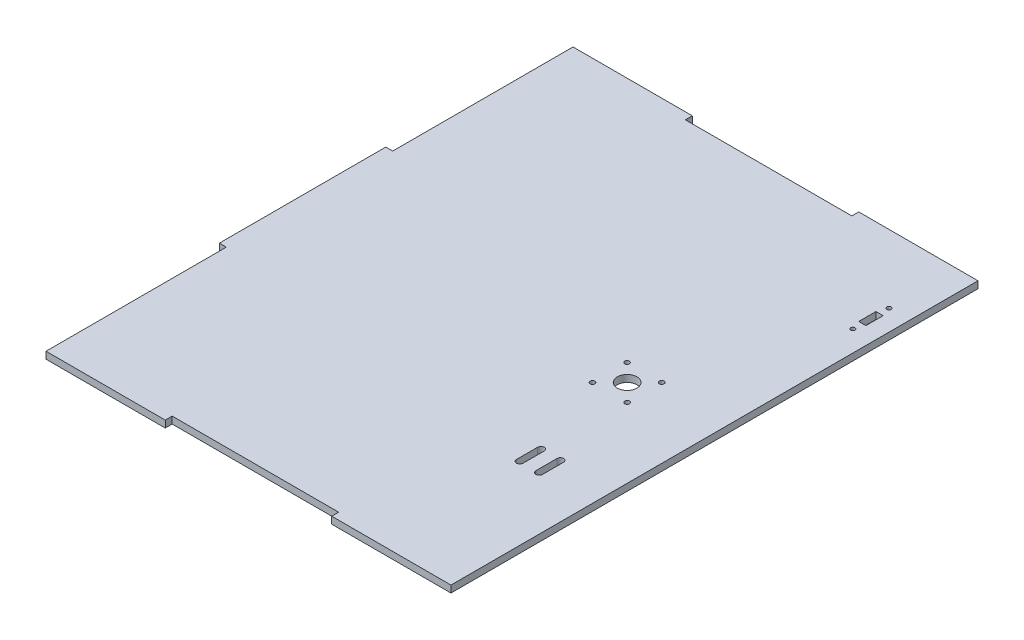
ISO-10303-21;
HEADER;
FILE_DESCRIPTION(('STEP AP214'),'2;1');
FILE_NAME('part.step','',(''),(''),'','','');
FILE_SCHEMA(('AUTOMOTIVE_DESIGN { 1 0 10303 214 1 1 1 1 }'));
ENDSEC;
DATA;
#1=APPLICATION_CONTEXT('core data for automotive mechanical design processes');
#2=APPLICATION_PROTOCOL_DEFINITION('international standard','automotive_design',2000,#1);
#3=PRODUCT_CONTEXT('',#1,'mechanical');
#4=PRODUCT('Part','Part','',(#3));
#5=PRODUCT_RELATED_PRODUCT_CATEGORY('part','',(#4));
#6=PRODUCT_DEFINITION_FORMATION('','',#4);
#7=PRODUCT_DEFINITION_CONTEXT('part definition',#1,'design');
#8=PRODUCT_DEFINITION('design','',#6,#7);
#9=PRODUCT_DEFINITION_SHAPE('','',#8);
#10=(LENGTH_UNIT() NAMED_UNIT(*) SI_UNIT(.MILLI.,.METRE.));
#11=(NAMED_UNIT(*) PLANE_ANGLE_UNIT() SI_UNIT($,.RADIAN.));
#12=(NAMED_UNIT(*) SI_UNIT($,.STERADIAN.) SOLID_ANGLE_UNIT());
#13=UNCERTAINTY_MEASURE_WITH_UNIT(LENGTH_MEASURE(1.E-05),#10,'distance_accuracy_value','');
#14=(GEOMETRIC_REPRESENTATION_CONTEXT(3) GLOBAL_UNCERTAINTY_ASSIGNED_CONTEXT((#13)) GLOBAL_UNIT_ASSIGNED_CONTEXT((#10,
#11,#12)) REPRESENTATION_CONTEXT('',''));
#15=CARTESIAN_POINT('',(0.,0.,0.));
#16=DIRECTION('',(0.,0.,1.));
#17=DIRECTION('',(1.,0.,0.));
#18=AXIS2_PLACEMENT_3D('',#15,#16,#17);
#19=CARTESIAN_POINT('',(0.,3.175,0.));
#20=DIRECTION('',(1.,0.,0.));
#21=DIRECTION('',(0.,0.,-1.));
#22=AXIS2_PLACEMENT_3D('',#19,#20,#21);
#23=PLANE('',#22);
#24=DIRECTION('',(0.,1.,0.));
#25=VECTOR('',#24,1.);
#26=CARTESIAN_POINT('',(0.,-76.2661171490984,-82.55));
#27=LINE('',#26,#25);
#28=CARTESIAN_POINT('',(0.,0.,-82.55));
#29=VERTEX_POINT('',#28);
#30=CARTESIAN_POINT('',(0.,3.175,-82.55));
#31=VERTEX_POINT('',#30);
#32=EDGE_CURVE('E249',#29,#31,#27,.T.);
#33=ORIENTED_EDGE('',*,*,#32,.F.);
#34=DIRECTION('',(0.,0.,1.));
#35=VECTOR('',#34,1.);
#36=CARTESIAN_POINT('',(0.,0.,0.));
#37=LINE('',#36,#35);
#38=CARTESIAN_POINT('',(0.,0.,0.));
#39=VERTEX_POINT('',#38);
#40=EDGE_CURVE('E439',#29,#39,#37,.T.);
#41=ORIENTED_EDGE('',*,*,#40,.T.);
#42=DIRECTION('',(0.,-1.,0.));
#43=VECTOR('',#42,1.);
#44=CARTESIAN_POINT('',(0.,3.175,0.));
#45=LINE('',#44,#43);
#46=CARTESIAN_POINT('',(0.,3.175,0.));
#47=VERTEX_POINT('',#46);
#48=EDGE_CURVE('E11',#47,#39,#45,.T.);
#49=ORIENTED_EDGE('',*,*,#48,.F.);
#50=DIRECTION('',(0.,0.,1.));
#51=VECTOR('',#50,1.);
#52=CARTESIAN_POINT('',(0.,3.175,0.));
#53=LINE('',#52,#51);
#54=EDGE_CURVE('E446',#31,#47,#53,.T.);
#55=ORIENTED_EDGE('',*,*,#54,.F.);
#56=EDGE_LOOP('',(#33,#41,#49,#55));
#57=FACE_BOUND('',#56,.T.);
#58=ADVANCED_FACE('F34',(#57),#23,.F.);
#59=CARTESIAN_POINT('',(0.,3.175,0.));
#60=DIRECTION('',(0.,0.,-1.));
#61=DIRECTION('',(-1.,0.,0.));
#62=AXIS2_PLACEMENT_3D('',#59,#60,#61);
#63=PLANE('',#62);
#64=DIRECTION('',(1.,0.,0.));
#65=VECTOR('',#64,1.);
#66=CARTESIAN_POINT('',(0.,0.,0.));
#67=LINE('',#66,#65);
#68=CARTESIAN_POINT('',(54.6100000000003,0.,0.));
#69=VERTEX_POINT('',#68);
#70=EDGE_CURVE('E460',#39,#69,#67,.T.);
#71=ORIENTED_EDGE('',*,*,#70,.T.);
#72=DIRECTION('',(0.,1.,0.));
#73=VECTOR('',#72,1.);
#74=CARTESIAN_POINT('',(54.6100000000003,0.,0.));
#75=LINE('',#74,#73);
#76=CARTESIAN_POINT('',(54.6100000000003,3.175,0.));
#77=VERTEX_POINT('',#76);
#78=EDGE_CURVE('E262',#69,#77,#75,.T.);
#79=ORIENTED_EDGE('',*,*,#78,.T.);
#80=DIRECTION('',(1.,0.,0.));
#81=VECTOR('',#80,1.);
#82=CARTESIAN_POINT('',(0.,3.175,0.));
#83=LINE('',#82,#81);
#84=EDGE_CURVE('E447',#47,#77,#83,.T.);
#85=ORIENTED_EDGE('',*,*,#84,.F.);
#86=ORIENTED_EDGE('',*,*,#48,.T.);
#87=EDGE_LOOP('',(#71,#79,#85,#86));
#88=FACE_BOUND('',#87,.T.);
#89=ADVANCED_FACE('F505',(#88),#63,.F.);
#90=CARTESIAN_POINT('',(0.,3.175,-241.3));
#91=DIRECTION('',(0.,0.,1.));
#92=DIRECTION('',(1.,0.,0.));
#93=AXIS2_PLACEMENT_3D('',#90,#91,#92);
#94=PLANE('',#93);
#95=DIRECTION('',(-1.,0.,0.));
#96=VECTOR('',#95,1.);
#97=CARTESIAN_POINT('',(0.,0.,-241.3));
#98=LINE('',#97,#96);
#99=CARTESIAN_POINT('',(185.42,0.,-241.3));
#100=VERTEX_POINT('',#99);
#101=CARTESIAN_POINT('',(130.81,0.,-241.3));
#102=VERTEX_POINT('',#101);
#103=EDGE_CURVE('E466',#100,#102,#98,.T.);
#104=ORIENTED_EDGE('',*,*,#103,.T.);
#105=DIRECTION('',(0.,1.,0.));
#106=VECTOR('',#105,1.);
#107=CARTESIAN_POINT('',(130.81,0.,-241.3));
#108=LINE('',#107,#106);
#109=CARTESIAN_POINT('',(130.81,3.175,-241.3));
#110=VERTEX_POINT('',#109);
#111=EDGE_CURVE('E288',#102,#110,#108,.T.);
#112=ORIENTED_EDGE('',*,*,#111,.T.);
#113=DIRECTION('',(-1.,0.,0.));
#114=VECTOR('',#113,1.);
#115=CARTESIAN_POINT('',(0.,3.175,-241.3));
#116=LINE('',#115,#114);
#117=CARTESIAN_POINT('',(185.42,3.175,-241.3));
#118=VERTEX_POINT('',#117);
#119=EDGE_CURVE('E453',#118,#110,#116,.T.);
#120=ORIENTED_EDGE('',*,*,#119,.F.);
#121=DIRECTION('',(0.,-1.,0.));
#122=VECTOR('',#121,1.);
#123=CARTESIAN_POINT('',(185.42,3.175,-241.3));
#124=LINE('',#123,#122);
#125=EDGE_CURVE('E471',#118,#100,#124,.T.);
#126=ORIENTED_EDGE('',*,*,#125,.T.);
#127=EDGE_LOOP('',(#104,#112,#120,#126));
#128=FACE_BOUND('',#127,.T.);
#129=ADVANCED_FACE('F486',(#128),#94,.F.);
#130=CARTESIAN_POINT('',(0.,3.175,0.));
#131=DIRECTION('',(0.,-1.,0.));
#132=DIRECTION('',(0.,0.,-1.));
#133=AXIS2_PLACEMENT_3D('',#130,#131,#132);
#134=PLANE('',#133);
#135=CARTESIAN_POINT('',(175.895,3.175,-193.548));
#136=DIRECTION('',(0.,-1.,0.));
#137=DIRECTION('',(0.,0.,-1.));
#138=AXIS2_PLACEMENT_3D('',#135,#136,#137);
#139=CIRCLE('',#138,0.999999999999998);
#140=CARTESIAN_POINT('',(175.895,3.175,-194.548));
#141=VERTEX_POINT('',#140);
#142=EDGE_CURVE('E304',#141,#141,#139,.T.);
#143=ORIENTED_EDGE('',*,*,#142,.T.);
#144=EDGE_LOOP('',(#143));
#145=FACE_BOUND('',#144,.T.);
#146=CARTESIAN_POINT('',(175.895,3.175,-210.058));
#147=DIRECTION('',(0.,-1.,0.));
#148=DIRECTION('',(0.,0.,1.));
#149=AXIS2_PLACEMENT_3D('',#146,#147,#148);
#150=CIRCLE('',#149,0.999999999999998);
#151=CARTESIAN_POINT('',(175.895,3.175,-209.058));
#152=VERTEX_POINT('',#151);
#153=EDGE_CURVE('E311',#152,#152,#150,.T.);
#154=ORIENTED_EDGE('',*,*,#153,.T.);
#155=EDGE_LOOP('',(#154));
#156=FACE_BOUND('',#155,.T.);
#157=DIRECTION('',(-1.,0.,0.));
#158=VECTOR('',#157,1.);
#159=CARTESIAN_POINT('',(174.244,3.175,-197.866));
#160=LINE('',#159,#158);
#161=CARTESIAN_POINT('',(177.546,3.175,-197.866));
#162=VERTEX_POINT('',#161);
#163=CARTESIAN_POINT('',(174.244,3.175,-197.866));
#164=VERTEX_POINT('',#163);
#165=EDGE_CURVE('E326',#162,#164,#160,.T.);
#166=ORIENTED_EDGE('',*,*,#165,.T.);
#167=DIRECTION('',(0.,0.,-1.));
#168=VECTOR('',#167,1.);
#169=CARTESIAN_POINT('',(174.244,3.175,-205.74));
#170=LINE('',#169,#168);
#171=CARTESIAN_POINT('',(174.244,3.175,-205.74));
#172=VERTEX_POINT('',#171);
#173=EDGE_CURVE('E316',#164,#172,#170,.T.);
#174=ORIENTED_EDGE('',*,*,#173,.T.);
#175=DIRECTION('',(1.,0.,0.));
#176=VECTOR('',#175,1.);
#177=CARTESIAN_POINT('',(174.244,3.175,-205.74));
#178=LINE('',#177,#176);
#179=CARTESIAN_POINT('',(177.546,3.175,-205.74));
#180=VERTEX_POINT('',#179);
#181=EDGE_CURVE('E319',#172,#180,#178,.T.);
#182=ORIENTED_EDGE('',*,*,#181,.T.);
#183=DIRECTION('',(0.,0.,1.));
#184=VECTOR('',#183,1.);
#185=CARTESIAN_POINT('',(177.546,3.175,-205.74));
#186=LINE('',#185,#184);
#187=EDGE_CURVE('E323',#180,#162,#186,.T.);
#188=ORIENTED_EDGE('',*,*,#187,.T.);
#189=EDGE_LOOP('',(#166,#174,#182,#188));
#190=FACE_BOUND('',#189,.T.);
#191=DIRECTION('',(0.,0.,-1.));
#192=VECTOR('',#191,1.);
#193=CARTESIAN_POINT('',(162.515,3.175,-64.796000096));
#194=LINE('',#193,#192);
#195=CARTESIAN_POINT('',(162.515,3.175,-64.796000096));
#196=VERTEX_POINT('',#195);
#197=CARTESIAN_POINT('',(162.515,3.175,-74.496000096));
#198=VERTEX_POINT('',#197);
#199=EDGE_CURVE('E363',#196,#198,#194,.T.);
#200=ORIENTED_EDGE('',*,*,#199,.F.);
#201=CARTESIAN_POINT('',(161.015,3.175,-64.796000096));
#202=DIRECTION('',(0.,1.,0.));
#203=DIRECTION('',(0.,0.,1.));
#204=AXIS2_PLACEMENT_3D('',#201,#202,#203);
#205=CIRCLE('',#204,1.49999999999997);
#206=CARTESIAN_POINT('',(159.515,3.175,-64.796000096));
#207=VERTEX_POINT('',#206);
#208=EDGE_CURVE('E341',#207,#196,#205,.T.);
#209=ORIENTED_EDGE('',*,*,#208,.F.);
#210=DIRECTION('',(0.,0.,1.));
#211=VECTOR('',#210,1.);
#212=CARTESIAN_POINT('',(159.515,3.175,-64.796000096));
#213=LINE('',#212,#211);
#214=CARTESIAN_POINT('',(159.515,3.175,-74.496000096));
#215=VERTEX_POINT('',#214);
#216=EDGE_CURVE('E352',#215,#207,#213,.T.);
#217=ORIENTED_EDGE('',*,*,#216,.F.);
#218=CARTESIAN_POINT('',(161.015,3.175,-74.496000096));
#219=DIRECTION('',(0.,1.,0.));
#220=DIRECTION('',(0.,0.,1.));
#221=AXIS2_PLACEMENT_3D('',#218,#219,#220);
#222=CIRCLE('',#221,1.49999999999997);
#223=EDGE_CURVE('E366',#198,#215,#222,.T.);
#224=ORIENTED_EDGE('',*,*,#223,.F.);
#225=EDGE_LOOP('',(#200,#209,#217,#224));
#226=FACE_BOUND('',#225,.T.);
#227=DIRECTION('',(0.,0.,-1.));
#228=VECTOR('',#227,1.);
#229=CARTESIAN_POINT('',(153.615,3.175,-64.796000096));
#230=LINE('',#229,#228);
#231=CARTESIAN_POINT('',(153.615,3.175,-64.796000096));
#232=VERTEX_POINT('',#231);
#233=CARTESIAN_POINT('',(153.615,3.175,-74.496000096));
#234=VERTEX_POINT('',#233);
#235=EDGE_CURVE('E395',#232,#234,#230,.T.);
#236=ORIENTED_EDGE('',*,*,#235,.F.);
#237=CARTESIAN_POINT('',(152.115,3.175,-64.796000096));
#238=DIRECTION('',(0.,1.,0.));
#239=DIRECTION('',(0.,0.,1.));
#240=AXIS2_PLACEMENT_3D('',#237,#238,#239);
#241=CIRCLE('',#240,1.49999999999997);
#242=CARTESIAN_POINT('',(150.615,3.175,-64.796000096));
#243=VERTEX_POINT('',#242);
#244=EDGE_CURVE('E373',#243,#232,#241,.T.);
#245=ORIENTED_EDGE('',*,*,#244,.F.);
#246=DIRECTION('',(0.,0.,1.));
#247=VECTOR('',#246,1.);
#248=CARTESIAN_POINT('',(150.615,3.175,-64.796000096));
#249=LINE('',#248,#247);
#250=CARTESIAN_POINT('',(150.615,3.175,-74.496000096));
#251=VERTEX_POINT('',#250);
#252=EDGE_CURVE('E384',#251,#243,#249,.T.);
#253=ORIENTED_EDGE('',*,*,#252,.F.);
#254=CARTESIAN_POINT('',(152.115,3.175,-74.496000096));
#255=DIRECTION('',(0.,1.,0.));
#256=DIRECTION('',(0.,0.,1.));
#257=AXIS2_PLACEMENT_3D('',#254,#255,#256);
#258=CIRCLE('',#257,1.49999999999997);
#259=EDGE_CURVE('E398',#234,#251,#258,.T.);
#260=ORIENTED_EDGE('',*,*,#259,.F.);
#261=EDGE_LOOP('',(#236,#245,#253,#260));
#262=FACE_BOUND('',#261,.T.);
#263=CARTESIAN_POINT('',(137.49168741186,3.175,-128.57331258814));
#264=DIRECTION('',(0.,1.,0.));
#265=DIRECTION('',(0.,0.,1.));
#266=AXIS2_PLACEMENT_3D('',#263,#264,#265);
#267=CIRCLE('',#266,1.09220000000001);
#268=CARTESIAN_POINT('',(137.49168741186,3.175,-127.48111258814));
#269=VERTEX_POINT('',#268);
#270=EDGE_CURVE('E425',#269,#269,#267,.T.);
#271=ORIENTED_EDGE('',*,*,#270,.F.);
#272=EDGE_LOOP('',(#271));
#273=FACE_BOUND('',#272,.T.);
#274=CARTESIAN_POINT('',(153.33831258814,3.175,-128.57331258814));
#275=DIRECTION('',(0.,-1.,0.));
#276=DIRECTION('',(0.,0.,-1.));
#277=AXIS2_PLACEMENT_3D('',#274,#275,#276);
#278=CIRCLE('',#277,1.09219999999999);
#279=CARTESIAN_POINT('',(153.33831258814,3.175,-129.66551258814));
#280=VERTEX_POINT('',#279);
#281=EDGE_CURVE('E431',#280,#280,#278,.T.);
#282=ORIENTED_EDGE('',*,*,#281,.T.);
#283=EDGE_LOOP('',(#282));
#284=FACE_BOUND('',#283,.T.);
#285=CARTESIAN_POINT('',(145.415,3.175,-120.65));
#286=DIRECTION('',(0.,1.,0.));
#287=DIRECTION('',(0.,0.,1.));
#288=AXIS2_PLACEMENT_3D('',#285,#286,#287);
#289=CIRCLE('',#288,4.49452999999999);
#290=CARTESIAN_POINT('',(145.415,3.175,-116.15547));
#291=VERTEX_POINT('',#290);
#292=EDGE_CURVE('E415',#291,#291,#289,.T.);
#293=ORIENTED_EDGE('',*,*,#292,.F.);
#294=EDGE_LOOP('',(#293));
#295=FACE_BOUND('',#294,.T.);
#296=ORIENTED_EDGE('',*,*,#84,.T.);
#297=DIRECTION('',(0.,0.,1.));
#298=VECTOR('',#297,1.);
#299=CARTESIAN_POINT('',(54.6100000000003,3.175,0.));
#300=LINE('',#299,#298);
#301=CARTESIAN_POINT('',(54.6100000000003,3.175,-3.17500000000001));
#302=VERTEX_POINT('',#301);
#303=EDGE_CURVE('E254',#302,#77,#300,.T.);
#304=ORIENTED_EDGE('',*,*,#303,.F.);
#305=DIRECTION('',(-1.,0.,0.));
#306=VECTOR('',#305,1.);
#307=CARTESIAN_POINT('',(54.6100000000003,3.175,-3.17500000000001));
#308=LINE('',#307,#306);
#309=CARTESIAN_POINT('',(130.81,3.175,-3.17500000000001));
#310=VERTEX_POINT('',#309);
#311=EDGE_CURVE('E257',#310,#302,#308,.T.);
#312=ORIENTED_EDGE('',*,*,#311,.F.);
#313=DIRECTION('',(0.,0.,-1.));
#314=VECTOR('',#313,1.);
#315=CARTESIAN_POINT('',(130.81,3.175,0.));
#316=LINE('',#315,#314);
#317=CARTESIAN_POINT('',(130.81,3.175,0.));
#318=VERTEX_POINT('',#317);
#319=EDGE_CURVE('E264',#318,#310,#316,.T.);
#320=ORIENTED_EDGE('',*,*,#319,.F.);
#321=CARTESIAN_POINT('',(185.42,3.175,0.));
#322=VERTEX_POINT('',#321);
#323=EDGE_CURVE('E445',#318,#322,#83,.T.);
#324=ORIENTED_EDGE('',*,*,#323,.T.);
#325=DIRECTION('',(0.,0.,-1.));
#326=VECTOR('',#325,1.);
#327=CARTESIAN_POINT('',(185.42,3.175,0.));
#328=LINE('',#327,#326);
#329=EDGE_CURVE('E450',#322,#118,#328,.T.);
#330=ORIENTED_EDGE('',*,*,#329,.T.);
#331=ORIENTED_EDGE('',*,*,#119,.T.);
#332=DIRECTION('',(0.,0.,-1.));
#333=VECTOR('',#332,1.);
#334=CARTESIAN_POINT('',(130.81,3.175,-241.3));
#335=LINE('',#334,#333);
#336=CARTESIAN_POINT('',(130.81,3.175,-238.125));
#337=VERTEX_POINT('',#336);
#338=EDGE_CURVE('E271',#337,#110,#335,.T.);
#339=ORIENTED_EDGE('',*,*,#338,.F.);
#340=DIRECTION('',(1.,0.,0.));
#341=VECTOR('',#340,1.);
#342=CARTESIAN_POINT('',(54.6100000000003,3.175,-238.125));
#343=LINE('',#342,#341);
#344=CARTESIAN_POINT('',(54.6100000000003,3.175,-238.125));
#345=VERTEX_POINT('',#344);
#346=EDGE_CURVE('E282',#345,#337,#343,.T.);
#347=ORIENTED_EDGE('',*,*,#346,.F.);
#348=DIRECTION('',(0.,0.,1.));
#349=VECTOR('',#348,1.);
#350=CARTESIAN_POINT('',(54.6100000000003,3.175,-241.3));
#351=LINE('',#350,#349);
#352=CARTESIAN_POINT('',(54.6100000000003,3.175,-241.3));
#353=VERTEX_POINT('',#352);
#354=EDGE_CURVE('E290',#353,#345,#351,.T.);
#355=ORIENTED_EDGE('',*,*,#354,.F.);
#356=CARTESIAN_POINT('',(0.,3.175,-241.3));
#357=VERTEX_POINT('',#356);
#358=EDGE_CURVE('E452',#353,#357,#116,.T.);
#359=ORIENTED_EDGE('',*,*,#358,.T.);
#360=CARTESIAN_POINT('',(0.,3.175,-158.75));
#361=VERTEX_POINT('',#360);
#362=EDGE_CURVE('E442',#357,#361,#53,.T.);
#363=ORIENTED_EDGE('',*,*,#362,.T.);
#364=DIRECTION('',(-1.,0.,0.));
#365=VECTOR('',#364,1.);
#366=CARTESIAN_POINT('',(-3.17500000000005,3.175,-158.75));
#367=LINE('',#366,#365);
#368=CARTESIAN_POINT('',(-3.17500000000005,3.175,-158.75));
#369=VERTEX_POINT('',#368);
#370=EDGE_CURVE('E49',#361,#369,#367,.T.);
#371=ORIENTED_EDGE('',*,*,#370,.T.);
#372=DIRECTION('',(0.,0.,1.));
#373=VECTOR('',#372,1.);
#374=CARTESIAN_POINT('',(-3.17500000000005,3.175,-158.75));
#375=LINE('',#374,#373);
#376=CARTESIAN_POINT('',(-3.17500000000004,3.175,-82.55));
#377=VERTEX_POINT('',#376);
#378=EDGE_CURVE('E237',#369,#377,#375,.T.);
#379=ORIENTED_EDGE('',*,*,#378,.T.);
#380=DIRECTION('',(1.,0.,0.));
#381=VECTOR('',#380,1.);
#382=CARTESIAN_POINT('',(-3.17500000000004,3.175,-82.55));
#383=LINE('',#382,#381);
#384=EDGE_CURVE('E242',#377,#31,#383,.T.);
#385=ORIENTED_EDGE('',*,*,#384,.T.);
#386=ORIENTED_EDGE('',*,*,#54,.T.);
#387=EDGE_LOOP('',(#296,#304,#312,#320,#324,#330,#331,#339,#347,#355,#359,#363,#371,#379,#385,#386));
#388=FACE_BOUND('',#387,.T.);
#389=CARTESIAN_POINT('',(137.49168741186,3.175,-112.72668741186));
#390=DIRECTION('',(0.,-1.,0.));
#391=DIRECTION('',(0.,0.,-1.));
#392=AXIS2_PLACEMENT_3D('',#389,#390,#391);
#393=CIRCLE('',#392,1.09220000000001);
#394=CARTESIAN_POINT('',(137.49168741186,3.175,-113.81888741186));
#395=VERTEX_POINT('',#394);
#396=EDGE_CURVE('E419',#395,#395,#393,.T.);
#397=ORIENTED_EDGE('',*,*,#396,.T.);
#398=EDGE_LOOP('',(#397));
#399=FACE_BOUND('',#398,.T.);
#400=CARTESIAN_POINT('',(153.33831258814,3.175,-112.72668741186));
#401=DIRECTION('',(0.,1.,0.));
#402=DIRECTION('',(0.,0.,1.));
#403=AXIS2_PLACEMENT_3D('',#400,#401,#402);
#404=CIRCLE('',#403,1.09219999999998);
#405=CARTESIAN_POINT('',(153.33831258814,3.175,-111.63448741186));
#406=VERTEX_POINT('',#405);
#407=EDGE_CURVE('E412',#406,#406,#404,.T.);
#408=ORIENTED_EDGE('',*,*,#407,.F.);
#409=EDGE_LOOP('',(#408));
#410=FACE_BOUND('',#409,.T.);
#411=ADVANCED_FACE('F490',(#145,#156,#190,#226,#262,#273,#284,#295,#388,#399,#410),#134,.F.);
#412=CARTESIAN_POINT('',(0.,0.,0.));
#413=DIRECTION('',(0.,-1.,0.));
#414=DIRECTION('',(0.,0.,-1.));
#415=AXIS2_PLACEMENT_3D('',#412,#413,#414);
#416=PLANE('',#415);
#417=DIRECTION('',(0.,0.,1.));
#418=VECTOR('',#417,1.);
#419=CARTESIAN_POINT('',(54.6100000000003,0.,0.));
#420=LINE('',#419,#418);
#421=CARTESIAN_POINT('',(54.6100000000003,0.,-3.17500000000001));
#422=VERTEX_POINT('',#421);
#423=EDGE_CURVE('E255',#422,#69,#420,.T.);
#424=ORIENTED_EDGE('',*,*,#423,.T.);
#425=ORIENTED_EDGE('',*,*,#70,.F.);
#426=ORIENTED_EDGE('',*,*,#40,.F.);
#427=DIRECTION('',(1.,0.,0.));
#428=VECTOR('',#427,1.);
#429=CARTESIAN_POINT('',(-3.17500000000004,0.,-82.55));
#430=LINE('',#429,#428);
#431=CARTESIAN_POINT('',(-3.17500000000004,0.,-82.55));
#432=VERTEX_POINT('',#431);
#433=EDGE_CURVE('E228',#432,#29,#430,.T.);
#434=ORIENTED_EDGE('',*,*,#433,.F.);
#435=DIRECTION('',(0.,0.,1.));
#436=VECTOR('',#435,1.);
#437=CARTESIAN_POINT('',(-3.17500000000005,0.,-158.75));
#438=LINE('',#437,#436);
#439=CARTESIAN_POINT('',(-3.17500000000005,0.,-158.75));
#440=VERTEX_POINT('',#439);
#441=EDGE_CURVE('E219',#440,#432,#438,.T.);
#442=ORIENTED_EDGE('',*,*,#441,.F.);
#443=DIRECTION('',(-1.,0.,0.));
#444=VECTOR('',#443,1.);
#445=CARTESIAN_POINT('',(-3.17500000000005,0.,-158.75));
#446=LINE('',#445,#444);
#447=CARTESIAN_POINT('',(0.,0.,-158.75));
#448=VERTEX_POINT('',#447);
#449=EDGE_CURVE('E226',#448,#440,#446,.T.);
#450=ORIENTED_EDGE('',*,*,#449,.F.);
#451=CARTESIAN_POINT('',(0.,0.,-241.3));
#452=VERTEX_POINT('',#451);
#453=EDGE_CURVE('E457',#452,#448,#37,.T.);
#454=ORIENTED_EDGE('',*,*,#453,.F.);
#455=CARTESIAN_POINT('',(54.6100000000003,0.,-241.3));
#456=VERTEX_POINT('',#455);
#457=EDGE_CURVE('E465',#456,#452,#98,.T.);
#458=ORIENTED_EDGE('',*,*,#457,.F.);
#459=DIRECTION('',(0.,0.,1.));
#460=VECTOR('',#459,1.);
#461=CARTESIAN_POINT('',(54.6100000000003,0.,-241.3));
#462=LINE('',#461,#460);
#463=CARTESIAN_POINT('',(54.6100000000003,0.,-238.125));
#464=VERTEX_POINT('',#463);
#465=EDGE_CURVE('E281',#456,#464,#462,.T.);
#466=ORIENTED_EDGE('',*,*,#465,.T.);
#467=DIRECTION('',(1.,0.,0.));
#468=VECTOR('',#467,1.);
#469=CARTESIAN_POINT('',(54.6100000000003,0.,-238.125));
#470=LINE('',#469,#468);
#471=CARTESIAN_POINT('',(130.81,0.,-238.125));
#472=VERTEX_POINT('',#471);
#473=EDGE_CURVE('E285',#464,#472,#470,.T.);
#474=ORIENTED_EDGE('',*,*,#473,.T.);
#475=DIRECTION('',(0.,0.,-1.));
#476=VECTOR('',#475,1.);
#477=CARTESIAN_POINT('',(130.81,0.,-241.3));
#478=LINE('',#477,#476);
#479=EDGE_CURVE('E278',#472,#102,#478,.T.);
#480=ORIENTED_EDGE('',*,*,#479,.T.);
#481=ORIENTED_EDGE('',*,*,#103,.F.);
#482=DIRECTION('',(0.,0.,-1.));
#483=VECTOR('',#482,1.);
#484=CARTESIAN_POINT('',(185.42,0.,0.));
#485=LINE('',#484,#483);
#486=CARTESIAN_POINT('',(185.42,0.,0.));
#487=VERTEX_POINT('',#486);
#488=EDGE_CURVE('E463',#487,#100,#485,.T.);
#489=ORIENTED_EDGE('',*,*,#488,.F.);
#490=CARTESIAN_POINT('',(130.81,0.,0.));
#491=VERTEX_POINT('',#490);
#492=EDGE_CURVE('E459',#491,#487,#67,.T.);
#493=ORIENTED_EDGE('',*,*,#492,.F.);
#494=DIRECTION('',(0.,0.,-1.));
#495=VECTOR('',#494,1.);
#496=CARTESIAN_POINT('',(130.81,0.,0.));
#497=LINE('',#496,#495);
#498=CARTESIAN_POINT('',(130.81,0.,-3.17500000000001));
#499=VERTEX_POINT('',#498);
#500=EDGE_CURVE('E57',#491,#499,#497,.T.);
#501=ORIENTED_EDGE('',*,*,#500,.T.);
#502=DIRECTION('',(-1.,0.,0.));
#503=VECTOR('',#502,1.);
#504=CARTESIAN_POINT('',(54.6100000000003,0.,-3.17500000000001));
#505=LINE('',#504,#503);
#506=EDGE_CURVE('E259',#499,#422,#505,.T.);
#507=ORIENTED_EDGE('',*,*,#506,.T.);
#508=EDGE_LOOP('',(#424,#425,#426,#434,#442,#450,#454,#458,#466,#474,#480,#481,#489,#493,#501,#507));
#509=FACE_BOUND('',#508,.T.);
#510=CARTESIAN_POINT('',(175.895,0.,-193.548));
#511=DIRECTION('',(0.,-1.,0.));
#512=DIRECTION('',(0.,0.,-1.));
#513=AXIS2_PLACEMENT_3D('',#510,#511,#512);
#514=CIRCLE('',#513,0.999999999999998);
#515=CARTESIAN_POINT('',(175.895,0.,-194.548));
#516=VERTEX_POINT('',#515);
#517=EDGE_CURVE('E308',#516,#516,#514,.T.);
#518=ORIENTED_EDGE('',*,*,#517,.F.);
#519=EDGE_LOOP('',(#518));
#520=FACE_BOUND('',#519,.T.);
#521=CARTESIAN_POINT('',(175.895,0.,-210.058));
#522=DIRECTION('',(0.,-1.,0.));
#523=DIRECTION('',(0.,0.,1.));
#524=AXIS2_PLACEMENT_3D('',#521,#522,#523);
#525=CIRCLE('',#524,0.999999999999998);
#526=CARTESIAN_POINT('',(175.895,0.,-209.058));
#527=VERTEX_POINT('',#526);
#528=EDGE_CURVE('E297',#527,#527,#525,.T.);
#529=ORIENTED_EDGE('',*,*,#528,.F.);
#530=EDGE_LOOP('',(#529));
#531=FACE_BOUND('',#530,.T.);
#532=DIRECTION('',(0.,0.,-1.));
#533=VECTOR('',#532,1.);
#534=CARTESIAN_POINT('',(174.244,0.,-205.74));
#535=LINE('',#534,#533);
#536=CARTESIAN_POINT('',(174.244,0.,-197.866));
#537=VERTEX_POINT('',#536);
#538=CARTESIAN_POINT('',(174.244,0.,-205.74));
#539=VERTEX_POINT('',#538);
#540=EDGE_CURVE('E307',#537,#539,#535,.T.);
#541=ORIENTED_EDGE('',*,*,#540,.F.);
#542=DIRECTION('',(-1.,0.,0.));
#543=VECTOR('',#542,1.);
#544=CARTESIAN_POINT('',(174.244,0.,-197.866));
#545=LINE('',#544,#543);
#546=CARTESIAN_POINT('',(177.546,0.,-197.866));
#547=VERTEX_POINT('',#546);
#548=EDGE_CURVE('E320',#547,#537,#545,.T.);
#549=ORIENTED_EDGE('',*,*,#548,.F.);
#550=DIRECTION('',(0.,0.,1.));
#551=VECTOR('',#550,1.);
#552=CARTESIAN_POINT('',(177.546,0.,-205.74));
#553=LINE('',#552,#551);
#554=CARTESIAN_POINT('',(177.546,0.,-205.74));
#555=VERTEX_POINT('',#554);
#556=EDGE_CURVE('E334',#555,#547,#553,.T.);
#557=ORIENTED_EDGE('',*,*,#556,.F.);
#558=DIRECTION('',(1.,0.,0.));
#559=VECTOR('',#558,1.);
#560=CARTESIAN_POINT('',(174.244,0.,-205.74));
#561=LINE('',#560,#559);
#562=EDGE_CURVE('E331',#539,#555,#561,.T.);
#563=ORIENTED_EDGE('',*,*,#562,.F.);
#564=EDGE_LOOP('',(#541,#549,#557,#563));
#565=FACE_BOUND('',#564,.T.);
#566=CARTESIAN_POINT('',(161.015,0.,-64.796000096));
#567=DIRECTION('',(0.,1.,0.));
#568=DIRECTION('',(0.,0.,1.));
#569=AXIS2_PLACEMENT_3D('',#566,#567,#568);
#570=CIRCLE('',#569,1.49999999999997);
#571=CARTESIAN_POINT('',(159.515,0.,-64.796000096));
#572=VERTEX_POINT('',#571);
#573=CARTESIAN_POINT('',(162.515,0.,-64.796000096));
#574=VERTEX_POINT('',#573);
#575=EDGE_CURVE('E348',#572,#574,#570,.T.);
#576=ORIENTED_EDGE('',*,*,#575,.T.);
#577=DIRECTION('',(0.,0.,-1.));
#578=VECTOR('',#577,1.);
#579=CARTESIAN_POINT('',(162.515,0.,-64.796000096));
#580=LINE('',#579,#578);
#581=CARTESIAN_POINT('',(162.515,0.,-74.496000096));
#582=VERTEX_POINT('',#581);
#583=EDGE_CURVE('E351',#574,#582,#580,.T.);
#584=ORIENTED_EDGE('',*,*,#583,.T.);
#585=CARTESIAN_POINT('',(161.015,0.,-74.496000096));
#586=DIRECTION('',(0.,1.,0.));
#587=DIRECTION('',(0.,0.,1.));
#588=AXIS2_PLACEMENT_3D('',#585,#586,#587);
#589=CIRCLE('',#588,1.49999999999997);
#590=CARTESIAN_POINT('',(159.515,0.,-74.496000096));
#591=VERTEX_POINT('',#590);
#592=EDGE_CURVE('E355',#582,#591,#589,.T.);
#593=ORIENTED_EDGE('',*,*,#592,.T.);
#594=DIRECTION('',(0.,0.,1.));
#595=VECTOR('',#594,1.);
#596=CARTESIAN_POINT('',(159.515,0.,-64.796000096));
#597=LINE('',#596,#595);
#598=EDGE_CURVE('E358',#591,#572,#597,.T.);
#599=ORIENTED_EDGE('',*,*,#598,.T.);
#600=EDGE_LOOP('',(#576,#584,#593,#599));
#601=FACE_BOUND('',#600,.T.);
#602=CARTESIAN_POINT('',(152.115,0.,-64.796000096));
#603=DIRECTION('',(0.,1.,0.));
#604=DIRECTION('',(0.,0.,1.));
#605=AXIS2_PLACEMENT_3D('',#602,#603,#604);
#606=CIRCLE('',#605,1.49999999999997);
#607=CARTESIAN_POINT('',(150.615,0.,-64.796000096));
#608=VERTEX_POINT('',#607);
#609=CARTESIAN_POINT('',(153.615,0.,-64.796000096));
#610=VERTEX_POINT('',#609);
#611=EDGE_CURVE('E380',#608,#610,#606,.T.);
#612=ORIENTED_EDGE('',*,*,#611,.T.);
#613=DIRECTION('',(0.,0.,-1.));
#614=VECTOR('',#613,1.);
#615=CARTESIAN_POINT('',(153.615,0.,-64.796000096));
#616=LINE('',#615,#614);
#617=CARTESIAN_POINT('',(153.615,0.,-74.496000096));
#618=VERTEX_POINT('',#617);
#619=EDGE_CURVE('E383',#610,#618,#616,.T.);
#620=ORIENTED_EDGE('',*,*,#619,.T.);
#621=CARTESIAN_POINT('',(152.115,0.,-74.496000096));
#622=DIRECTION('',(0.,1.,0.));
#623=DIRECTION('',(0.,0.,1.));
#624=AXIS2_PLACEMENT_3D('',#621,#622,#623);
#625=CIRCLE('',#624,1.49999999999997);
#626=CARTESIAN_POINT('',(150.615,0.,-74.496000096));
#627=VERTEX_POINT('',#626);
#628=EDGE_CURVE('E387',#618,#627,#625,.T.);
#629=ORIENTED_EDGE('',*,*,#628,.T.);
#630=DIRECTION('',(0.,0.,1.));
#631=VECTOR('',#630,1.);
#632=CARTESIAN_POINT('',(150.615,0.,-64.796000096));
#633=LINE('',#632,#631);
#634=EDGE_CURVE('E390',#627,#608,#633,.T.);
#635=ORIENTED_EDGE('',*,*,#634,.T.);
#636=EDGE_LOOP('',(#612,#620,#629,#635));
#637=FACE_BOUND('',#636,.T.);
#638=CARTESIAN_POINT('',(137.49168741186,0.,-112.72668741186));
#639=DIRECTION('',(0.,-1.,0.));
#640=DIRECTION('',(0.,0.,-1.));
#641=AXIS2_PLACEMENT_3D('',#638,#639,#640);
#642=CIRCLE('',#641,1.09220000000001);
#643=CARTESIAN_POINT('',(137.49168741186,0.,-113.81888741186));
#644=VERTEX_POINT('',#643);
#645=EDGE_CURVE('E422',#644,#644,#642,.T.);
#646=ORIENTED_EDGE('',*,*,#645,.F.);
#647=EDGE_LOOP('',(#646));
#648=FACE_BOUND('',#647,.T.);
#649=CARTESIAN_POINT('',(153.33831258814,0.,-128.57331258814));
#650=DIRECTION('',(0.,-1.,0.));
#651=DIRECTION('',(0.,0.,-1.));
#652=AXIS2_PLACEMENT_3D('',#649,#650,#651);
#653=CIRCLE('',#652,1.09219999999999);
#654=CARTESIAN_POINT('',(153.33831258814,0.,-129.66551258814));
#655=VERTEX_POINT('',#654);
#656=EDGE_CURVE('E405',#655,#655,#653,.T.);
#657=ORIENTED_EDGE('',*,*,#656,.F.);
#658=EDGE_LOOP('',(#657));
#659=FACE_BOUND('',#658,.T.);
#660=CARTESIAN_POINT('',(145.415,0.,-120.65));
#661=DIRECTION('',(0.,1.,0.));
#662=DIRECTION('',(0.,0.,1.));
#663=AXIS2_PLACEMENT_3D('',#660,#661,#662);
#664=CIRCLE('',#663,4.49452999999999);
#665=CARTESIAN_POINT('',(145.415,0.,-116.15547));
#666=VERTEX_POINT('',#665);
#667=EDGE_CURVE('E436',#666,#666,#664,.T.);
#668=ORIENTED_EDGE('',*,*,#667,.T.);
#669=EDGE_LOOP('',(#668));
#670=FACE_BOUND('',#669,.T.);
#671=CARTESIAN_POINT('',(137.49168741186,0.,-128.57331258814));
#672=DIRECTION('',(0.,1.,0.));
#673=DIRECTION('',(0.,0.,1.));
#674=AXIS2_PLACEMENT_3D('',#671,#672,#673);
#675=CIRCLE('',#674,1.09220000000001);
#676=CARTESIAN_POINT('',(137.49168741186,0.,-127.48111258814));
#677=VERTEX_POINT('',#676);
#678=EDGE_CURVE('E428',#677,#677,#675,.T.);
#679=ORIENTED_EDGE('',*,*,#678,.T.);
#680=EDGE_LOOP('',(#679));
#681=FACE_BOUND('',#680,.T.);
#682=CARTESIAN_POINT('',(153.33831258814,0.,-112.72668741186));
#683=DIRECTION('',(0.,1.,0.));
#684=DIRECTION('',(0.,0.,1.));
#685=AXIS2_PLACEMENT_3D('',#682,#683,#684);
#686=CIRCLE('',#685,1.09219999999998);
#687=CARTESIAN_POINT('',(153.33831258814,0.,-111.63448741186));
#688=VERTEX_POINT('',#687);
#689=EDGE_CURVE('E416',#688,#688,#686,.T.);
#690=ORIENTED_EDGE('',*,*,#689,.T.);
#691=EDGE_LOOP('',(#690));
#692=FACE_BOUND('',#691,.T.);
#693=ADVANCED_FACE('F222',(#509,#520,#531,#565,#601,#637,#648,#659,#670,#681,#692),#416,.T.);
#694=ORIENTED_EDGE('',*,*,#453,.T.);
#695=DIRECTION('',(0.,1.,0.));
#696=VECTOR('',#695,1.);
#697=CARTESIAN_POINT('',(0.,-76.2661171490984,-158.75));
#698=LINE('',#697,#696);
#699=EDGE_CURVE('E240',#448,#361,#698,.T.);
#700=ORIENTED_EDGE('',*,*,#699,.T.);
#701=ORIENTED_EDGE('',*,*,#362,.F.);
#702=DIRECTION('',(0.,-1.,0.));
#703=VECTOR('',#702,1.);
#704=CARTESIAN_POINT('',(0.,3.175,-241.3));
#705=LINE('',#704,#703);
#706=EDGE_CURVE('E456',#357,#452,#705,.T.);
#707=ORIENTED_EDGE('',*,*,#706,.T.);
#708=EDGE_LOOP('',(#694,#700,#701,#707));
#709=FACE_BOUND('',#708,.T.);
#710=ADVANCED_FACE('F36',(#709),#23,.F.);
#711=ORIENTED_EDGE('',*,*,#323,.F.);
#712=DIRECTION('',(0.,1.,0.));
#713=VECTOR('',#712,1.);
#714=CARTESIAN_POINT('',(130.81,0.,0.));
#715=LINE('',#714,#713);
#716=EDGE_CURVE('E274',#491,#318,#715,.T.);
#717=ORIENTED_EDGE('',*,*,#716,.F.);
#718=ORIENTED_EDGE('',*,*,#492,.T.);
#719=DIRECTION('',(0.,-1.,0.));
#720=VECTOR('',#719,1.);
#721=CARTESIAN_POINT('',(185.42,3.175,0.));
#722=LINE('',#721,#720);
#723=EDGE_CURVE('E42',#322,#487,#722,.T.);
#724=ORIENTED_EDGE('',*,*,#723,.F.);
#725=EDGE_LOOP('',(#711,#717,#718,#724));
#726=FACE_BOUND('',#725,.T.);
#727=ADVANCED_FACE('F495',(#726),#63,.F.);
#728=CARTESIAN_POINT('',(185.42,3.175,0.));
#729=DIRECTION('',(-1.,0.,0.));
#730=DIRECTION('',(0.,0.,1.));
#731=AXIS2_PLACEMENT_3D('',#728,#729,#730);
#732=PLANE('',#731);
#733=ORIENTED_EDGE('',*,*,#488,.T.);
#734=ORIENTED_EDGE('',*,*,#125,.F.);
#735=ORIENTED_EDGE('',*,*,#329,.F.);
#736=ORIENTED_EDGE('',*,*,#723,.T.);
#737=EDGE_LOOP('',(#733,#734,#735,#736));
#738=FACE_BOUND('',#737,.T.);
#739=ADVANCED_FACE('F478',(#738),#732,.F.);
#740=ORIENTED_EDGE('',*,*,#358,.F.);
#741=DIRECTION('',(0.,1.,0.));
#742=VECTOR('',#741,1.);
#743=CARTESIAN_POINT('',(54.6100000000003,0.,-241.3));
#744=LINE('',#743,#742);
#745=EDGE_CURVE('E300',#456,#353,#744,.T.);
#746=ORIENTED_EDGE('',*,*,#745,.F.);
#747=ORIENTED_EDGE('',*,*,#457,.T.);
#748=ORIENTED_EDGE('',*,*,#706,.F.);
#749=EDGE_LOOP('',(#740,#746,#747,#748));
#750=FACE_BOUND('',#749,.T.);
#751=ADVANCED_FACE('F522',(#750),#94,.F.);
#752=CARTESIAN_POINT('',(145.415,0.,-120.65));
#753=DIRECTION('',(0.,1.,0.));
#754=DIRECTION('',(0.,0.,1.));
#755=AXIS2_PLACEMENT_3D('',#752,#753,#754);
#756=CYLINDRICAL_SURFACE('',#755,4.49452999999999);
#757=ORIENTED_EDGE('',*,*,#292,.T.);
#758=EDGE_LOOP('',(#757));
#759=FACE_BOUND('',#758,.T.);
#760=ORIENTED_EDGE('',*,*,#667,.F.);
#761=EDGE_LOOP('',(#760));
#762=FACE_BOUND('',#761,.T.);
#763=ADVANCED_FACE('F561',(#759,#762),#756,.F.);
#764=CARTESIAN_POINT('',(153.33831258814,0.,-128.57331258814));
#765=DIRECTION('',(0.,1.,0.));
#766=DIRECTION('',(0.,0.,1.));
#767=AXIS2_PLACEMENT_3D('',#764,#765,#766);
#768=CYLINDRICAL_SURFACE('',#767,1.09219999999999);
#769=ORIENTED_EDGE('',*,*,#656,.T.);
#770=EDGE_LOOP('',(#769));
#771=FACE_BOUND('',#770,.T.);
#772=ORIENTED_EDGE('',*,*,#281,.F.);
#773=EDGE_LOOP('',(#772));
#774=FACE_BOUND('',#773,.T.);
#775=ADVANCED_FACE('F577',(#771,#774),#768,.F.);
#776=CARTESIAN_POINT('',(137.49168741186,0.,-128.57331258814));
#777=DIRECTION('',(0.,1.,0.));
#778=DIRECTION('',(0.,0.,1.));
#779=AXIS2_PLACEMENT_3D('',#776,#777,#778);
#780=CYLINDRICAL_SURFACE('',#779,1.09220000000001);
#781=ORIENTED_EDGE('',*,*,#678,.F.);
#782=EDGE_LOOP('',(#781));
#783=FACE_BOUND('',#782,.T.);
#784=ORIENTED_EDGE('',*,*,#270,.T.);
#785=EDGE_LOOP('',(#784));
#786=FACE_BOUND('',#785,.T.);
#787=ADVANCED_FACE('F584',(#783,#786),#780,.F.);
#788=CARTESIAN_POINT('',(137.49168741186,0.,-112.72668741186));
#789=DIRECTION('',(0.,1.,0.));
#790=DIRECTION('',(0.,0.,1.));
#791=AXIS2_PLACEMENT_3D('',#788,#789,#790);
#792=CYLINDRICAL_SURFACE('',#791,1.09220000000001);
#793=ORIENTED_EDGE('',*,*,#645,.T.);
#794=EDGE_LOOP('',(#793));
#795=FACE_BOUND('',#794,.T.);
#796=ORIENTED_EDGE('',*,*,#396,.F.);
#797=EDGE_LOOP('',(#796));
#798=FACE_BOUND('',#797,.T.);
#799=ADVANCED_FACE('F592',(#795,#798),#792,.F.);
#800=CARTESIAN_POINT('',(153.33831258814,0.,-112.72668741186));
#801=DIRECTION('',(0.,1.,0.));
#802=DIRECTION('',(0.,0.,1.));
#803=AXIS2_PLACEMENT_3D('',#800,#801,#802);
#804=CYLINDRICAL_SURFACE('',#803,1.09219999999998);
#805=ORIENTED_EDGE('',*,*,#689,.F.);
#806=EDGE_LOOP('',(#805));
#807=FACE_BOUND('',#806,.T.);
#808=ORIENTED_EDGE('',*,*,#407,.T.);
#809=EDGE_LOOP('',(#808));
#810=FACE_BOUND('',#809,.T.);
#811=ADVANCED_FACE('F600',(#807,#810),#804,.F.);
#812=CARTESIAN_POINT('',(152.115,0.,-64.796000096));
#813=DIRECTION('',(0.,1.,0.));
#814=DIRECTION('',(0.,0.,1.));
#815=AXIS2_PLACEMENT_3D('',#812,#813,#814);
#816=CYLINDRICAL_SURFACE('',#815,1.49999999999997);
#817=ORIENTED_EDGE('',*,*,#244,.T.);
#818=DIRECTION('',(0.,1.,0.));
#819=VECTOR('',#818,1.);
#820=CARTESIAN_POINT('',(153.615,0.,-64.796000096));
#821=LINE('',#820,#819);
#822=EDGE_CURVE('E393',#610,#232,#821,.T.);
#823=ORIENTED_EDGE('',*,*,#822,.F.);
#824=ORIENTED_EDGE('',*,*,#611,.F.);
#825=DIRECTION('',(0.,1.,0.));
#826=VECTOR('',#825,1.);
#827=CARTESIAN_POINT('',(150.615,0.,-64.796000096));
#828=LINE('',#827,#826);
#829=EDGE_CURVE('E403',#608,#243,#828,.T.);
#830=ORIENTED_EDGE('',*,*,#829,.T.);
#831=EDGE_LOOP('',(#817,#823,#824,#830));
#832=FACE_BOUND('',#831,.T.);
#833=ADVANCED_FACE('F608',(#832),#816,.F.);
#834=CARTESIAN_POINT('',(150.615,0.,-64.796000096));
#835=DIRECTION('',(-1.,0.,0.));
#836=DIRECTION('',(0.,0.,1.));
#837=AXIS2_PLACEMENT_3D('',#834,#835,#836);
#838=PLANE('',#837);
#839=ORIENTED_EDGE('',*,*,#252,.T.);
#840=ORIENTED_EDGE('',*,*,#829,.F.);
#841=ORIENTED_EDGE('',*,*,#634,.F.);
#842=DIRECTION('',(0.,1.,0.));
#843=VECTOR('',#842,1.);
#844=CARTESIAN_POINT('',(150.615,0.,-74.496000096));
#845=LINE('',#844,#843);
#846=EDGE_CURVE('E406',#627,#251,#845,.T.);
#847=ORIENTED_EDGE('',*,*,#846,.T.);
#848=EDGE_LOOP('',(#839,#840,#841,#847));
#849=FACE_BOUND('',#848,.T.);
#850=ADVANCED_FACE('F616',(#849),#838,.F.);
#851=CARTESIAN_POINT('',(152.115,0.,-74.496000096));
#852=DIRECTION('',(0.,1.,0.));
#853=DIRECTION('',(0.,0.,1.));
#854=AXIS2_PLACEMENT_3D('',#851,#852,#853);
#855=CYLINDRICAL_SURFACE('',#854,1.49999999999997);
#856=ORIENTED_EDGE('',*,*,#259,.T.);
#857=ORIENTED_EDGE('',*,*,#846,.F.);
#858=ORIENTED_EDGE('',*,*,#628,.F.);
#859=DIRECTION('',(0.,1.,0.));
#860=VECTOR('',#859,1.);
#861=CARTESIAN_POINT('',(153.615,0.,-74.496000096));
#862=LINE('',#861,#860);
#863=EDGE_CURVE('E408',#618,#234,#862,.T.);
#864=ORIENTED_EDGE('',*,*,#863,.T.);
#865=EDGE_LOOP('',(#856,#857,#858,#864));
#866=FACE_BOUND('',#865,.T.);
#867=ADVANCED_FACE('F624',(#866),#855,.F.);
#868=CARTESIAN_POINT('',(153.615,0.,-64.796000096));
#869=DIRECTION('',(1.,0.,0.));
#870=DIRECTION('',(0.,0.,-1.));
#871=AXIS2_PLACEMENT_3D('',#868,#869,#870);
#872=PLANE('',#871);
#873=ORIENTED_EDGE('',*,*,#235,.T.);
#874=ORIENTED_EDGE('',*,*,#863,.F.);
#875=ORIENTED_EDGE('',*,*,#619,.F.);
#876=ORIENTED_EDGE('',*,*,#822,.T.);
#877=EDGE_LOOP('',(#873,#874,#875,#876));
#878=FACE_BOUND('',#877,.T.);
#879=ADVANCED_FACE('F632',(#878),#872,.F.);
#880=CARTESIAN_POINT('',(161.015,0.,-64.796000096));
#881=DIRECTION('',(0.,1.,0.));
#882=DIRECTION('',(0.,0.,1.));
#883=AXIS2_PLACEMENT_3D('',#880,#881,#882);
#884=CYLINDRICAL_SURFACE('',#883,1.49999999999997);
#885=ORIENTED_EDGE('',*,*,#208,.T.);
#886=DIRECTION('',(0.,1.,0.));
#887=VECTOR('',#886,1.);
#888=CARTESIAN_POINT('',(162.515,0.,-64.796000096));
#889=LINE('',#888,#887);
#890=EDGE_CURVE('E361',#574,#196,#889,.T.);
#891=ORIENTED_EDGE('',*,*,#890,.F.);
#892=ORIENTED_EDGE('',*,*,#575,.F.);
#893=DIRECTION('',(0.,1.,0.));
#894=VECTOR('',#893,1.);
#895=CARTESIAN_POINT('',(159.515,0.,-64.796000096));
#896=LINE('',#895,#894);
#897=EDGE_CURVE('E371',#572,#207,#896,.T.);
#898=ORIENTED_EDGE('',*,*,#897,.T.);
#899=EDGE_LOOP('',(#885,#891,#892,#898));
#900=FACE_BOUND('',#899,.T.);
#901=ADVANCED_FACE('F640',(#900),#884,.F.);
#902=CARTESIAN_POINT('',(159.515,0.,-64.796000096));
#903=DIRECTION('',(-1.,0.,0.));
#904=DIRECTION('',(0.,0.,1.));
#905=AXIS2_PLACEMENT_3D('',#902,#903,#904);
#906=PLANE('',#905);
#907=ORIENTED_EDGE('',*,*,#216,.T.);
#908=ORIENTED_EDGE('',*,*,#897,.F.);
#909=ORIENTED_EDGE('',*,*,#598,.F.);
#910=DIRECTION('',(0.,1.,0.));
#911=VECTOR('',#910,1.);
#912=CARTESIAN_POINT('',(159.515,0.,-74.496000096));
#913=LINE('',#912,#911);
#914=EDGE_CURVE('E374',#591,#215,#913,.T.);
#915=ORIENTED_EDGE('',*,*,#914,.T.);
#916=EDGE_LOOP('',(#907,#908,#909,#915));
#917=FACE_BOUND('',#916,.T.);
#918=ADVANCED_FACE('F648',(#917),#906,.F.);
#919=CARTESIAN_POINT('',(161.015,0.,-74.496000096));
#920=DIRECTION('',(0.,1.,0.));
#921=DIRECTION('',(0.,0.,1.));
#922=AXIS2_PLACEMENT_3D('',#919,#920,#921);
#923=CYLINDRICAL_SURFACE('',#922,1.49999999999997);
#924=ORIENTED_EDGE('',*,*,#223,.T.);
#925=ORIENTED_EDGE('',*,*,#914,.F.);
#926=ORIENTED_EDGE('',*,*,#592,.F.);
#927=DIRECTION('',(0.,1.,0.));
#928=VECTOR('',#927,1.);
#929=CARTESIAN_POINT('',(162.515,0.,-74.496000096));
#930=LINE('',#929,#928);
#931=EDGE_CURVE('E376',#582,#198,#930,.T.);
#932=ORIENTED_EDGE('',*,*,#931,.T.);
#933=EDGE_LOOP('',(#924,#925,#926,#932));
#934=FACE_BOUND('',#933,.T.);
#935=ADVANCED_FACE('F656',(#934),#923,.F.);
#936=CARTESIAN_POINT('',(162.515,0.,-64.796000096));
#937=DIRECTION('',(1.,0.,0.));
#938=DIRECTION('',(0.,0.,-1.));
#939=AXIS2_PLACEMENT_3D('',#936,#937,#938);
#940=PLANE('',#939);
#941=ORIENTED_EDGE('',*,*,#199,.T.);
#942=ORIENTED_EDGE('',*,*,#931,.F.);
#943=ORIENTED_EDGE('',*,*,#583,.F.);
#944=ORIENTED_EDGE('',*,*,#890,.T.);
#945=EDGE_LOOP('',(#941,#942,#943,#944));
#946=FACE_BOUND('',#945,.T.);
#947=ADVANCED_FACE('F664',(#946),#940,.F.);
#948=CARTESIAN_POINT('',(174.244,3.175,-205.74));
#949=DIRECTION('',(-1.,0.,0.));
#950=DIRECTION('',(0.,0.,1.));
#951=AXIS2_PLACEMENT_3D('',#948,#949,#950);
#952=PLANE('',#951);
#953=ORIENTED_EDGE('',*,*,#540,.T.);
#954=DIRECTION('',(0.,-1.,0.));
#955=VECTOR('',#954,1.);
#956=CARTESIAN_POINT('',(174.244,3.175,-205.74));
#957=LINE('',#956,#955);
#958=EDGE_CURVE('E329',#172,#539,#957,.T.);
#959=ORIENTED_EDGE('',*,*,#958,.F.);
#960=ORIENTED_EDGE('',*,*,#173,.F.);
#961=DIRECTION('',(0.,-1.,0.));
#962=VECTOR('',#961,1.);
#963=CARTESIAN_POINT('',(174.244,3.175,-197.866));
#964=LINE('',#963,#962);
#965=EDGE_CURVE('E339',#164,#537,#964,.T.);
#966=ORIENTED_EDGE('',*,*,#965,.T.);
#967=EDGE_LOOP('',(#953,#959,#960,#966));
#968=FACE_BOUND('',#967,.T.);
#969=ADVANCED_FACE('F672',(#968),#952,.F.);
#970=CARTESIAN_POINT('',(174.244,3.175,-197.866));
#971=DIRECTION('',(0.,0.,1.));
#972=DIRECTION('',(1.,0.,0.));
#973=AXIS2_PLACEMENT_3D('',#970,#971,#972);
#974=PLANE('',#973);
#975=ORIENTED_EDGE('',*,*,#548,.T.);
#976=ORIENTED_EDGE('',*,*,#965,.F.);
#977=ORIENTED_EDGE('',*,*,#165,.F.);
#978=DIRECTION('',(0.,-1.,0.));
#979=VECTOR('',#978,1.);
#980=CARTESIAN_POINT('',(177.546,3.175,-197.866));
#981=LINE('',#980,#979);
#982=EDGE_CURVE('E342',#162,#547,#981,.T.);
#983=ORIENTED_EDGE('',*,*,#982,.T.);
#984=EDGE_LOOP('',(#975,#976,#977,#983));
#985=FACE_BOUND('',#984,.T.);
#986=ADVANCED_FACE('F680',(#985),#974,.F.);
#987=CARTESIAN_POINT('',(177.546,3.175,-205.74));
#988=DIRECTION('',(1.,0.,0.));
#989=DIRECTION('',(0.,0.,-1.));
#990=AXIS2_PLACEMENT_3D('',#987,#988,#989);
#991=PLANE('',#990);
#992=ORIENTED_EDGE('',*,*,#556,.T.);
#993=ORIENTED_EDGE('',*,*,#982,.F.);
#994=ORIENTED_EDGE('',*,*,#187,.F.);
#995=DIRECTION('',(0.,-1.,0.));
#996=VECTOR('',#995,1.);
#997=CARTESIAN_POINT('',(177.546,3.175,-205.74));
#998=LINE('',#997,#996);
#999=EDGE_CURVE('E344',#180,#555,#998,.T.);
#1000=ORIENTED_EDGE('',*,*,#999,.T.);
#1001=EDGE_LOOP('',(#992,#993,#994,#1000));
#1002=FACE_BOUND('',#1001,.T.);
#1003=ADVANCED_FACE('F688',(#1002),#991,.F.);
#1004=CARTESIAN_POINT('',(174.244,3.175,-205.74));
#1005=DIRECTION('',(0.,0.,-1.));
#1006=DIRECTION('',(-1.,0.,0.));
#1007=AXIS2_PLACEMENT_3D('',#1004,#1005,#1006);
#1008=PLANE('',#1007);
#1009=ORIENTED_EDGE('',*,*,#562,.T.);
#1010=ORIENTED_EDGE('',*,*,#999,.F.);
#1011=ORIENTED_EDGE('',*,*,#181,.F.);
#1012=ORIENTED_EDGE('',*,*,#958,.T.);
#1013=EDGE_LOOP('',(#1009,#1010,#1011,#1012));
#1014=FACE_BOUND('',#1013,.T.);
#1015=ADVANCED_FACE('F696',(#1014),#1008,.F.);
#1016=CARTESIAN_POINT('',(175.895,3.175,-210.058));
#1017=DIRECTION('',(0.,-1.,0.));
#1018=DIRECTION('',(0.,0.,-1.));
#1019=AXIS2_PLACEMENT_3D('',#1016,#1017,#1018);
#1020=CYLINDRICAL_SURFACE('',#1019,0.999999999999998);
#1021=ORIENTED_EDGE('',*,*,#153,.F.);
#1022=EDGE_LOOP('',(#1021));
#1023=FACE_BOUND('',#1022,.T.);
#1024=ORIENTED_EDGE('',*,*,#528,.T.);
#1025=EDGE_LOOP('',(#1024));
#1026=FACE_BOUND('',#1025,.T.);
#1027=ADVANCED_FACE('F538',(#1023,#1026),#1020,.F.);
#1028=CARTESIAN_POINT('',(175.895,3.175,-193.548));
#1029=DIRECTION('',(0.,-1.,0.));
#1030=DIRECTION('',(0.,0.,-1.));
#1031=AXIS2_PLACEMENT_3D('',#1028,#1029,#1030);
#1032=CYLINDRICAL_SURFACE('',#1031,0.999999999999998);
#1033=ORIENTED_EDGE('',*,*,#142,.F.);
#1034=EDGE_LOOP('',(#1033));
#1035=FACE_BOUND('',#1034,.T.);
#1036=ORIENTED_EDGE('',*,*,#517,.T.);
#1037=EDGE_LOOP('',(#1036));
#1038=FACE_BOUND('',#1037,.T.);
#1039=ADVANCED_FACE('F531',(#1035,#1038),#1032,.F.);
#1040=CARTESIAN_POINT('',(130.81,0.,-241.3));
#1041=DIRECTION('',(1.,0.,0.));
#1042=DIRECTION('',(0.,0.,-1.));
#1043=AXIS2_PLACEMENT_3D('',#1040,#1041,#1042);
#1044=PLANE('',#1043);
#1045=ORIENTED_EDGE('',*,*,#338,.T.);
#1046=ORIENTED_EDGE('',*,*,#111,.F.);
#1047=ORIENTED_EDGE('',*,*,#479,.F.);
#1048=DIRECTION('',(0.,1.,0.));
#1049=VECTOR('',#1048,1.);
#1050=CARTESIAN_POINT('',(130.81,0.,-238.125));
#1051=LINE('',#1050,#1049);
#1052=EDGE_CURVE('E295',#472,#337,#1051,.T.);
#1053=ORIENTED_EDGE('',*,*,#1052,.T.);
#1054=EDGE_LOOP('',(#1045,#1046,#1047,#1053));
#1055=FACE_BOUND('',#1054,.T.);
#1056=ADVANCED_FACE('F529',(#1055),#1044,.F.);
#1057=CARTESIAN_POINT('',(54.6100000000003,0.,-238.125));
#1058=DIRECTION('',(0.,0.,1.));
#1059=DIRECTION('',(1.,0.,0.));
#1060=AXIS2_PLACEMENT_3D('',#1057,#1058,#1059);
#1061=PLANE('',#1060);
#1062=ORIENTED_EDGE('',*,*,#346,.T.);
#1063=ORIENTED_EDGE('',*,*,#1052,.F.);
#1064=ORIENTED_EDGE('',*,*,#473,.F.);
#1065=DIRECTION('',(0.,1.,0.));
#1066=VECTOR('',#1065,1.);
#1067=CARTESIAN_POINT('',(54.6100000000003,0.,-238.125));
#1068=LINE('',#1067,#1066);
#1069=EDGE_CURVE('E298',#464,#345,#1068,.T.);
#1070=ORIENTED_EDGE('',*,*,#1069,.T.);
#1071=EDGE_LOOP('',(#1062,#1063,#1064,#1070));
#1072=FACE_BOUND('',#1071,.T.);
#1073=ADVANCED_FACE('F526',(#1072),#1061,.F.);
#1074=CARTESIAN_POINT('',(54.6100000000003,0.,-241.3));
#1075=DIRECTION('',(-1.,0.,0.));
#1076=DIRECTION('',(0.,0.,1.));
#1077=AXIS2_PLACEMENT_3D('',#1074,#1075,#1076);
#1078=PLANE('',#1077);
#1079=ORIENTED_EDGE('',*,*,#354,.T.);
#1080=ORIENTED_EDGE('',*,*,#1069,.F.);
#1081=ORIENTED_EDGE('',*,*,#465,.F.);
#1082=ORIENTED_EDGE('',*,*,#745,.T.);
#1083=EDGE_LOOP('',(#1079,#1080,#1081,#1082));
#1084=FACE_BOUND('',#1083,.T.);
#1085=ADVANCED_FACE('F524',(#1084),#1078,.F.);
#1086=CARTESIAN_POINT('',(54.6100000000003,0.,0.));
#1087=DIRECTION('',(-1.,0.,0.));
#1088=DIRECTION('',(0.,0.,1.));
#1089=AXIS2_PLACEMENT_3D('',#1086,#1087,#1088);
#1090=PLANE('',#1089);
#1091=ORIENTED_EDGE('',*,*,#303,.T.);
#1092=ORIENTED_EDGE('',*,*,#78,.F.);
#1093=ORIENTED_EDGE('',*,*,#423,.F.);
#1094=DIRECTION('',(0.,1.,0.));
#1095=VECTOR('',#1094,1.);
#1096=CARTESIAN_POINT('',(54.6100000000003,0.,-3.17500000000001));
#1097=LINE('',#1096,#1095);
#1098=EDGE_CURVE('E269',#422,#302,#1097,.T.);
#1099=ORIENTED_EDGE('',*,*,#1098,.T.);
#1100=EDGE_LOOP('',(#1091,#1092,#1093,#1099));
#1101=FACE_BOUND('',#1100,.T.);
#1102=ADVANCED_FACE('F816',(#1101),#1090,.F.);
#1103=CARTESIAN_POINT('',(54.6100000000003,0.,-3.17500000000001));
#1104=DIRECTION('',(0.,0.,-1.));
#1105=DIRECTION('',(-1.,0.,0.));
#1106=AXIS2_PLACEMENT_3D('',#1103,#1104,#1105);
#1107=PLANE('',#1106);
#1108=ORIENTED_EDGE('',*,*,#311,.T.);
#1109=ORIENTED_EDGE('',*,*,#1098,.F.);
#1110=ORIENTED_EDGE('',*,*,#506,.F.);
#1111=DIRECTION('',(0.,1.,0.));
#1112=VECTOR('',#1111,1.);
#1113=CARTESIAN_POINT('',(130.81,0.,-3.17500000000001));
#1114=LINE('',#1113,#1112);
#1115=EDGE_CURVE('E272',#499,#310,#1114,.T.);
#1116=ORIENTED_EDGE('',*,*,#1115,.T.);
#1117=EDGE_LOOP('',(#1108,#1109,#1110,#1116));
#1118=FACE_BOUND('',#1117,.T.);
#1119=ADVANCED_FACE('F500',(#1118),#1107,.F.);
#1120=CARTESIAN_POINT('',(130.81,0.,0.));
#1121=DIRECTION('',(1.,0.,0.));
#1122=DIRECTION('',(0.,0.,-1.));
#1123=AXIS2_PLACEMENT_3D('',#1120,#1121,#1122);
#1124=PLANE('',#1123);
#1125=ORIENTED_EDGE('',*,*,#319,.T.);
#1126=ORIENTED_EDGE('',*,*,#1115,.F.);
#1127=ORIENTED_EDGE('',*,*,#500,.F.);
#1128=ORIENTED_EDGE('',*,*,#716,.T.);
#1129=EDGE_LOOP('',(#1125,#1126,#1127,#1128));
#1130=FACE_BOUND('',#1129,.T.);
#1131=ADVANCED_FACE('F496',(#1130),#1124,.F.);
#1132=CARTESIAN_POINT('',(-3.17500000000005,-76.2661171490984,-158.75));
#1133=DIRECTION('',(0.,0.,-1.));
#1134=DIRECTION('',(-1.,0.,0.));
#1135=AXIS2_PLACEMENT_3D('',#1132,#1133,#1134);
#1136=PLANE('',#1135);
#1137=ORIENTED_EDGE('',*,*,#699,.F.);
#1138=ORIENTED_EDGE('',*,*,#449,.T.);
#1139=DIRECTION('',(0.,1.,0.));
#1140=VECTOR('',#1139,1.);
#1141=CARTESIAN_POINT('',(-3.17500000000005,-76.2661171490984,-158.75));
#1142=LINE('',#1141,#1140);
#1143=EDGE_CURVE('E232',#440,#369,#1142,.T.);
#1144=ORIENTED_EDGE('',*,*,#1143,.T.);
#1145=ORIENTED_EDGE('',*,*,#370,.F.);
#1146=EDGE_LOOP('',(#1137,#1138,#1144,#1145));
#1147=FACE_BOUND('',#1146,.T.);
#1148=ADVANCED_FACE('F239',(#1147),#1136,.T.);
#1149=CARTESIAN_POINT('',(-3.17500000000005,-76.2661171490984,-158.75));
#1150=DIRECTION('',(-1.,0.,0.));
#1151=DIRECTION('',(0.,0.,1.));
#1152=AXIS2_PLACEMENT_3D('',#1149,#1150,#1151);
#1153=PLANE('',#1152);
#1154=ORIENTED_EDGE('',*,*,#1143,.F.);
#1155=ORIENTED_EDGE('',*,*,#441,.T.);
#1156=DIRECTION('',(0.,1.,0.));
#1157=VECTOR('',#1156,1.);
#1158=CARTESIAN_POINT('',(-3.17500000000004,-76.2661171490984,-82.55));
#1159=LINE('',#1158,#1157);
#1160=EDGE_CURVE('E231',#432,#377,#1159,.T.);
#1161=ORIENTED_EDGE('',*,*,#1160,.T.);
#1162=ORIENTED_EDGE('',*,*,#378,.F.);
#1163=EDGE_LOOP('',(#1154,#1155,#1161,#1162));
#1164=FACE_BOUND('',#1163,.T.);
#1165=ADVANCED_FACE('F235',(#1164),#1153,.T.);
#1166=CARTESIAN_POINT('',(-3.17500000000004,-76.2661171490984,-82.55));
#1167=DIRECTION('',(0.,0.,1.));
#1168=DIRECTION('',(1.,0.,0.));
#1169=AXIS2_PLACEMENT_3D('',#1166,#1167,#1168);
#1170=PLANE('',#1169);
#1171=ORIENTED_EDGE('',*,*,#1160,.F.);
#1172=ORIENTED_EDGE('',*,*,#433,.T.);
#1173=ORIENTED_EDGE('',*,*,#32,.T.);
#1174=ORIENTED_EDGE('',*,*,#384,.F.);
#1175=EDGE_LOOP('',(#1171,#1172,#1173,#1174));
#1176=FACE_BOUND('',#1175,.T.);
#1177=ADVANCED_FACE('F513',(#1176),#1170,.T.);
#1178=CLOSED_SHELL('',(#58,#89,#129,#411,#693,#710,#727,#739,#751,#763,#775,#787,#799,#811,#833,
#850,#867,#879,#901,#918,#935,#947,#969,#986,#1003,#1015,#1027,#1039,#1056,#1073,#1085,#1102,
#1119,#1131,#1148,#1165,#1177));
#1179=MANIFOLD_SOLID_BREP('B2',#1178);
#1180=ADVANCED_BREP_SHAPE_REPRESENTATION('',(#18,#1179),#14);
#1181=SHAPE_DEFINITION_REPRESENTATION(#9,#1180);
ENDSEC;
END-ISO-10303-21;
